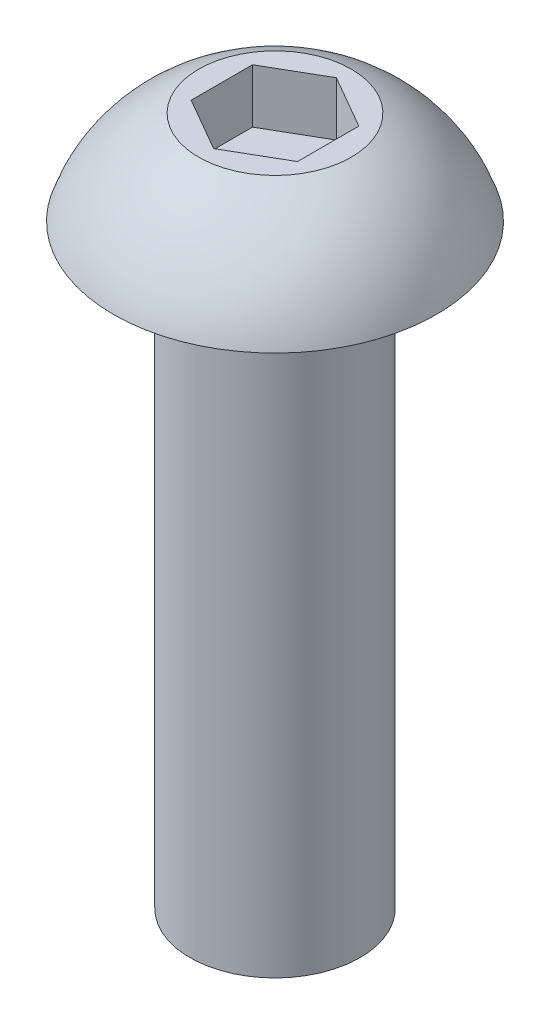
ISO-10303-21;
HEADER;
FILE_DESCRIPTION(('STEP AP214'),'2;1');
FILE_NAME('part.step','',(''),(''),'','','');
FILE_SCHEMA(('AUTOMOTIVE_DESIGN { 1 0 10303 214 1 1 1 1 }'));
ENDSEC;
DATA;
#1=APPLICATION_CONTEXT('core data for automotive mechanical design processes');
#2=APPLICATION_PROTOCOL_DEFINITION('international standard','automotive_design',2000,#1);
#3=PRODUCT_CONTEXT('',#1,'mechanical');
#4=PRODUCT('Part','Part','',(#3));
#5=PRODUCT_RELATED_PRODUCT_CATEGORY('part','',(#4));
#6=PRODUCT_DEFINITION_FORMATION('','',#4);
#7=PRODUCT_DEFINITION_CONTEXT('part definition',#1,'design');
#8=PRODUCT_DEFINITION('design','',#6,#7);
#9=PRODUCT_DEFINITION_SHAPE('','',#8);
#10=(LENGTH_UNIT() NAMED_UNIT(*) SI_UNIT(.MILLI.,.METRE.));
#11=(NAMED_UNIT(*) PLANE_ANGLE_UNIT() SI_UNIT($,.RADIAN.));
#12=(NAMED_UNIT(*) SI_UNIT($,.STERADIAN.) SOLID_ANGLE_UNIT());
#13=UNCERTAINTY_MEASURE_WITH_UNIT(LENGTH_MEASURE(1.E-05),#10,'distance_accuracy_value','');
#14=(GEOMETRIC_REPRESENTATION_CONTEXT(3) GLOBAL_UNCERTAINTY_ASSIGNED_CONTEXT((#13)) GLOBAL_UNIT_ASSIGNED_CONTEXT((#10,
#11,#12)) REPRESENTATION_CONTEXT('',''));
#15=CARTESIAN_POINT('',(0.,0.,0.));
#16=DIRECTION('',(0.,0.,1.));
#17=DIRECTION('',(1.,0.,0.));
#18=AXIS2_PLACEMENT_3D('',#15,#16,#17);
#19=CARTESIAN_POINT('',(0.,-14.,0.));
#20=DIRECTION('',(0.,-1.,0.));
#21=DIRECTION('',(0.,0.,-1.));
#22=AXIS2_PLACEMENT_3D('',#19,#20,#21);
#23=CYLINDRICAL_SURFACE('',#22,2.);
#24=CARTESIAN_POINT('',(0.,-14.,0.));
#25=DIRECTION('',(0.,-1.,0.));
#26=DIRECTION('',(0.,0.,-1.));
#27=AXIS2_PLACEMENT_3D('',#24,#25,#26);
#28=CIRCLE('',#27,2.);
#29=CARTESIAN_POINT('',(0.,-14.,-2.));
#30=VERTEX_POINT('',#29);
#31=EDGE_CURVE('E136',#30,#30,#28,.T.);
#32=ORIENTED_EDGE('',*,*,#31,.F.);
#33=EDGE_LOOP('',(#32));
#34=FACE_BOUND('',#33,.T.);
#35=CARTESIAN_POINT('',(0.,0.,0.));
#36=DIRECTION('',(0.,-1.,0.));
#37=DIRECTION('',(0.,0.,-1.));
#38=AXIS2_PLACEMENT_3D('',#35,#36,#37);
#39=CIRCLE('',#38,2.);
#40=CARTESIAN_POINT('',(0.,0.,-2.));
#41=VERTEX_POINT('',#40);
#42=EDGE_CURVE('E11',#41,#41,#39,.T.);
#43=ORIENTED_EDGE('',*,*,#42,.T.);
#44=EDGE_LOOP('',(#43));
#45=FACE_BOUND('',#44,.T.);
#46=ADVANCED_FACE('F35',(#34,#45),#23,.T.);
#47=CARTESIAN_POINT('',(-2.,0.,0.));
#48=DIRECTION('',(0.,1.,0.));
#49=DIRECTION('',(0.,0.,1.));
#50=AXIS2_PLACEMENT_3D('',#47,#48,#49);
#51=PLANE('',#50);
#52=ORIENTED_EDGE('',*,*,#42,.F.);
#53=EDGE_LOOP('',(#52));
#54=FACE_BOUND('',#53,.T.);
#55=CARTESIAN_POINT('',(0.,0.,0.));
#56=DIRECTION('',(0.,-1.,0.));
#57=DIRECTION('',(0.,0.,-1.));
#58=AXIS2_PLACEMENT_3D('',#55,#56,#57);
#59=CIRCLE('',#58,3.8);
#60=CARTESIAN_POINT('',(0.,0.,-3.8));
#61=VERTEX_POINT('',#60);
#62=EDGE_CURVE('E42',#61,#61,#59,.T.);
#63=ORIENTED_EDGE('',*,*,#62,.T.);
#64=EDGE_LOOP('',(#63));
#65=FACE_BOUND('',#64,.T.);
#66=ADVANCED_FACE('F149',(#54,#65),#51,.F.);
#67=CARTESIAN_POINT('',(0.,-1.07943817047447,0.));
#68=DIRECTION('',(0.,-1.,0.));
#69=DIRECTION('',(0.,0.,-1.));
#70=AXIS2_PLACEMENT_3D('',#67,#68,#69);
#71=DEGENERATE_TOROIDAL_SURFACE('',#70,0.406255794748707,3.5612759643917,.T.);
#72=ORIENTED_EDGE('',*,*,#62,.F.);
#73=EDGE_LOOP('',(#72));
#74=FACE_BOUND('',#73,.T.);
#75=CARTESIAN_POINT('',(0.,2.2,0.));
#76=DIRECTION('',(0.,-1.,0.));
#77=DIRECTION('',(0.,0.,-1.));
#78=AXIS2_PLACEMENT_3D('',#75,#76,#77);
#79=CIRCLE('',#78,1.7947700296736);
#80=CARTESIAN_POINT('',(0.,2.2,-1.7947700296736));
#81=VERTEX_POINT('',#80);
#82=EDGE_CURVE('E144',#81,#81,#79,.T.);
#83=ORIENTED_EDGE('',*,*,#82,.T.);
#84=EDGE_LOOP('',(#83));
#85=FACE_BOUND('',#84,.T.);
#86=ADVANCED_FACE('F151',(#74,#85),#71,.T.);
#87=CARTESIAN_POINT('',(0.,2.2,0.));
#88=DIRECTION('',(0.,-1.,0.));
#89=DIRECTION('',(0.,0.,-1.));
#90=AXIS2_PLACEMENT_3D('',#87,#88,#89);
#91=PLANE('',#90);
#92=DIRECTION('',(0.,0.,1.));
#93=VECTOR('',#92,1.);
#94=CARTESIAN_POINT('',(-1.25,2.2,-0.721687836487032));
#95=LINE('',#94,#93);
#96=CARTESIAN_POINT('',(-1.25,2.2,-0.721687836487032));
#97=VERTEX_POINT('',#96);
#98=CARTESIAN_POINT('',(-1.25,2.2,0.721687836487032));
#99=VERTEX_POINT('',#98);
#100=EDGE_CURVE('E123',#97,#99,#95,.T.);
#101=ORIENTED_EDGE('',*,*,#100,.F.);
#102=DIRECTION('',(-0.866025403784438,0.,0.5));
#103=VECTOR('',#102,1.);
#104=CARTESIAN_POINT('',(0.,2.2,-1.44337567297406));
#105=LINE('',#104,#103);
#106=CARTESIAN_POINT('',(0.,2.2,-1.44337567297406));
#107=VERTEX_POINT('',#106);
#108=EDGE_CURVE('E49',#107,#97,#105,.T.);
#109=ORIENTED_EDGE('',*,*,#108,.F.);
#110=DIRECTION('',(-0.866025403784439,0.,-0.5));
#111=VECTOR('',#110,1.);
#112=CARTESIAN_POINT('',(1.25,2.2,-0.721687836487033));
#113=LINE('',#112,#111);
#114=CARTESIAN_POINT('',(1.25,2.2,-0.721687836487033));
#115=VERTEX_POINT('',#114);
#116=EDGE_CURVE('E132',#115,#107,#113,.T.);
#117=ORIENTED_EDGE('',*,*,#116,.F.);
#118=DIRECTION('',(0.,0.,-1.));
#119=VECTOR('',#118,1.);
#120=CARTESIAN_POINT('',(1.25,2.2,0.721687836487032));
#121=LINE('',#120,#119);
#122=CARTESIAN_POINT('',(1.25,2.2,0.721687836487032));
#123=VERTEX_POINT('',#122);
#124=EDGE_CURVE('E130',#123,#115,#121,.T.);
#125=ORIENTED_EDGE('',*,*,#124,.F.);
#126=DIRECTION('',(0.866025403784438,0.,-0.5));
#127=VECTOR('',#126,1.);
#128=CARTESIAN_POINT('',(0.,2.2,1.44337567297406));
#129=LINE('',#128,#127);
#130=CARTESIAN_POINT('',(0.,2.2,1.44337567297406));
#131=VERTEX_POINT('',#130);
#132=EDGE_CURVE('E97',#131,#123,#129,.T.);
#133=ORIENTED_EDGE('',*,*,#132,.F.);
#134=DIRECTION('',(0.866025403784439,0.,0.5));
#135=VECTOR('',#134,1.);
#136=CARTESIAN_POINT('',(-1.25,2.2,0.721687836487032));
#137=LINE('',#136,#135);
#138=EDGE_CURVE('E126',#99,#131,#137,.T.);
#139=ORIENTED_EDGE('',*,*,#138,.F.);
#140=EDGE_LOOP('',(#101,#109,#117,#125,#133,#139));
#141=FACE_BOUND('',#140,.T.);
#142=ORIENTED_EDGE('',*,*,#82,.F.);
#143=EDGE_LOOP('',(#142));
#144=FACE_BOUND('',#143,.T.);
#145=ADVANCED_FACE('F154',(#141,#144),#91,.F.);
#146=CARTESIAN_POINT('',(-2.,-14.,0.));
#147=DIRECTION('',(0.,1.,0.));
#148=DIRECTION('',(0.,0.,1.));
#149=AXIS2_PLACEMENT_3D('',#146,#147,#148);
#150=PLANE('',#149);
#151=ORIENTED_EDGE('',*,*,#31,.T.);
#152=EDGE_LOOP('',(#151));
#153=FACE_BOUND('',#152,.T.);
#154=ADVANCED_FACE('F159',(#153),#150,.F.);
#155=CARTESIAN_POINT('',(0.,0.93,-1.44337567297406));
#156=DIRECTION('',(-0.5,0.,-0.866025403784439));
#157=DIRECTION('',(-0.866025403784438,0.,0.5));
#158=AXIS2_PLACEMENT_3D('',#155,#156,#157);
#159=PLANE('',#158);
#160=ORIENTED_EDGE('',*,*,#108,.T.);
#161=DIRECTION('',(0.,1.,0.));
#162=VECTOR('',#161,1.);
#163=CARTESIAN_POINT('',(-1.25,0.93,-0.721687836487032));
#164=LINE('',#163,#162);
#165=CARTESIAN_POINT('',(-1.25,0.93,-0.721687836487032));
#166=VERTEX_POINT('',#165);
#167=EDGE_CURVE('E79',#166,#97,#164,.T.);
#168=ORIENTED_EDGE('',*,*,#167,.F.);
#169=DIRECTION('',(-0.866025403784438,0.,0.5));
#170=VECTOR('',#169,1.);
#171=CARTESIAN_POINT('',(0.,0.93,-1.44337567297406));
#172=LINE('',#171,#170);
#173=CARTESIAN_POINT('',(0.,0.93,-1.44337567297406));
#174=VERTEX_POINT('',#173);
#175=EDGE_CURVE('E134',#174,#166,#172,.T.);
#176=ORIENTED_EDGE('',*,*,#175,.F.);
#177=DIRECTION('',(0.,1.,0.));
#178=VECTOR('',#177,1.);
#179=CARTESIAN_POINT('',(0.,0.93,-1.44337567297406));
#180=LINE('',#179,#178);
#181=EDGE_CURVE('E57',#174,#107,#180,.T.);
#182=ORIENTED_EDGE('',*,*,#181,.T.);
#183=EDGE_LOOP('',(#160,#168,#176,#182));
#184=FACE_BOUND('',#183,.T.);
#185=ADVANCED_FACE('F165',(#184),#159,.F.);
#186=CARTESIAN_POINT('',(1.25,0.93,-0.721687836487033));
#187=DIRECTION('',(0.5,0.,-0.866025403784439));
#188=DIRECTION('',(-0.866025403784439,0.,-0.5));
#189=AXIS2_PLACEMENT_3D('',#186,#187,#188);
#190=PLANE('',#189);
#191=ORIENTED_EDGE('',*,*,#116,.T.);
#192=ORIENTED_EDGE('',*,*,#181,.F.);
#193=DIRECTION('',(-0.866025403784439,0.,-0.5));
#194=VECTOR('',#193,1.);
#195=CARTESIAN_POINT('',(1.25,0.93,-0.721687836487033));
#196=LINE('',#195,#194);
#197=CARTESIAN_POINT('',(1.25,0.93,-0.721687836487033));
#198=VERTEX_POINT('',#197);
#199=EDGE_CURVE('E109',#198,#174,#196,.T.);
#200=ORIENTED_EDGE('',*,*,#199,.F.);
#201=DIRECTION('',(0.,1.,0.));
#202=VECTOR('',#201,1.);
#203=CARTESIAN_POINT('',(1.25,0.93,-0.721687836487033));
#204=LINE('',#203,#202);
#205=EDGE_CURVE('E101',#198,#115,#204,.T.);
#206=ORIENTED_EDGE('',*,*,#205,.T.);
#207=EDGE_LOOP('',(#191,#192,#200,#206));
#208=FACE_BOUND('',#207,.T.);
#209=ADVANCED_FACE('F203',(#208),#190,.F.);
#210=CARTESIAN_POINT('',(1.25,0.93,0.721687836487032));
#211=DIRECTION('',(1.,0.,0.));
#212=DIRECTION('',(0.,0.,-1.));
#213=AXIS2_PLACEMENT_3D('',#210,#211,#212);
#214=PLANE('',#213);
#215=ORIENTED_EDGE('',*,*,#124,.T.);
#216=ORIENTED_EDGE('',*,*,#205,.F.);
#217=DIRECTION('',(0.,0.,-1.));
#218=VECTOR('',#217,1.);
#219=CARTESIAN_POINT('',(1.25,0.93,0.721687836487032));
#220=LINE('',#219,#218);
#221=CARTESIAN_POINT('',(1.25,0.93,0.721687836487032));
#222=VERTEX_POINT('',#221);
#223=EDGE_CURVE('E105',#222,#198,#220,.T.);
#224=ORIENTED_EDGE('',*,*,#223,.F.);
#225=DIRECTION('',(0.,1.,0.));
#226=VECTOR('',#225,1.);
#227=CARTESIAN_POINT('',(1.25,0.93,0.721687836487032));
#228=LINE('',#227,#226);
#229=EDGE_CURVE('E90',#222,#123,#228,.T.);
#230=ORIENTED_EDGE('',*,*,#229,.T.);
#231=EDGE_LOOP('',(#215,#216,#224,#230));
#232=FACE_BOUND('',#231,.T.);
#233=ADVANCED_FACE('F106',(#232),#214,.F.);
#234=CARTESIAN_POINT('',(0.,0.93,1.44337567297406));
#235=DIRECTION('',(0.5,0.,0.866025403784438));
#236=DIRECTION('',(0.866025403784439,0.,-0.5));
#237=AXIS2_PLACEMENT_3D('',#234,#235,#236);
#238=PLANE('',#237);
#239=ORIENTED_EDGE('',*,*,#132,.T.);
#240=ORIENTED_EDGE('',*,*,#229,.F.);
#241=DIRECTION('',(0.866025403784438,0.,-0.5));
#242=VECTOR('',#241,1.);
#243=CARTESIAN_POINT('',(0.,0.93,1.44337567297406));
#244=LINE('',#243,#242);
#245=CARTESIAN_POINT('',(0.,0.93,1.44337567297406));
#246=VERTEX_POINT('',#245);
#247=EDGE_CURVE('E94',#246,#222,#244,.T.);
#248=ORIENTED_EDGE('',*,*,#247,.F.);
#249=DIRECTION('',(0.,1.,0.));
#250=VECTOR('',#249,1.);
#251=CARTESIAN_POINT('',(0.,0.93,1.44337567297406));
#252=LINE('',#251,#250);
#253=EDGE_CURVE('E102',#246,#131,#252,.T.);
#254=ORIENTED_EDGE('',*,*,#253,.T.);
#255=EDGE_LOOP('',(#239,#240,#248,#254));
#256=FACE_BOUND('',#255,.T.);
#257=ADVANCED_FACE('F92',(#256),#238,.F.);
#258=CARTESIAN_POINT('',(-1.25,0.93,0.721687836487032));
#259=DIRECTION('',(-0.5,0.,0.866025403784439));
#260=DIRECTION('',(0.866025403784439,0.,0.5));
#261=AXIS2_PLACEMENT_3D('',#258,#259,#260);
#262=PLANE('',#261);
#263=ORIENTED_EDGE('',*,*,#138,.T.);
#264=ORIENTED_EDGE('',*,*,#253,.F.);
#265=DIRECTION('',(0.866025403784439,0.,0.5));
#266=VECTOR('',#265,1.);
#267=CARTESIAN_POINT('',(-1.25,0.93,0.721687836487032));
#268=LINE('',#267,#266);
#269=CARTESIAN_POINT('',(-1.25,0.93,0.721687836487032));
#270=VERTEX_POINT('',#269);
#271=EDGE_CURVE('E115',#270,#246,#268,.T.);
#272=ORIENTED_EDGE('',*,*,#271,.F.);
#273=DIRECTION('',(0.,1.,0.));
#274=VECTOR('',#273,1.);
#275=CARTESIAN_POINT('',(-1.25,0.93,0.721687836487032));
#276=LINE('',#275,#274);
#277=EDGE_CURVE('E139',#270,#99,#276,.T.);
#278=ORIENTED_EDGE('',*,*,#277,.T.);
#279=EDGE_LOOP('',(#263,#264,#272,#278));
#280=FACE_BOUND('',#279,.T.);
#281=ADVANCED_FACE('F228',(#280),#262,.F.);
#282=CARTESIAN_POINT('',(-1.25,0.93,-0.721687836487032));
#283=DIRECTION('',(-1.,0.,0.));
#284=DIRECTION('',(0.,0.,1.));
#285=AXIS2_PLACEMENT_3D('',#282,#283,#284);
#286=PLANE('',#285);
#287=ORIENTED_EDGE('',*,*,#100,.T.);
#288=ORIENTED_EDGE('',*,*,#277,.F.);
#289=DIRECTION('',(0.,0.,1.));
#290=VECTOR('',#289,1.);
#291=CARTESIAN_POINT('',(-1.25,0.93,-0.721687836487032));
#292=LINE('',#291,#290);
#293=EDGE_CURVE('E117',#166,#270,#292,.T.);
#294=ORIENTED_EDGE('',*,*,#293,.F.);
#295=ORIENTED_EDGE('',*,*,#167,.T.);
#296=EDGE_LOOP('',(#287,#288,#294,#295));
#297=FACE_BOUND('',#296,.T.);
#298=ADVANCED_FACE('F237',(#297),#286,.F.);
#299=CARTESIAN_POINT('',(0.,0.93,0.));
#300=DIRECTION('',(0.,1.,0.));
#301=DIRECTION('',(0.,0.,1.));
#302=AXIS2_PLACEMENT_3D('',#299,#300,#301);
#303=PLANE('',#302);
#304=ORIENTED_EDGE('',*,*,#175,.T.);
#305=ORIENTED_EDGE('',*,*,#293,.T.);
#306=ORIENTED_EDGE('',*,*,#271,.T.);
#307=ORIENTED_EDGE('',*,*,#247,.T.);
#308=ORIENTED_EDGE('',*,*,#223,.T.);
#309=ORIENTED_EDGE('',*,*,#199,.T.);
#310=EDGE_LOOP('',(#304,#305,#306,#307,#308,#309));
#311=FACE_BOUND('',#310,.T.);
#312=ADVANCED_FACE('F112',(#311),#303,.T.);
#313=CLOSED_SHELL('',(#46,#66,#86,#145,#154,#185,#209,#233,#257,#281,#298,#312));
#314=MANIFOLD_SOLID_BREP('B2',#313);
#315=ADVANCED_BREP_SHAPE_REPRESENTATION('',(#18,#314),#14);
#316=SHAPE_DEFINITION_REPRESENTATION(#9,#315);
ENDSEC;
END-ISO-10303-21;
